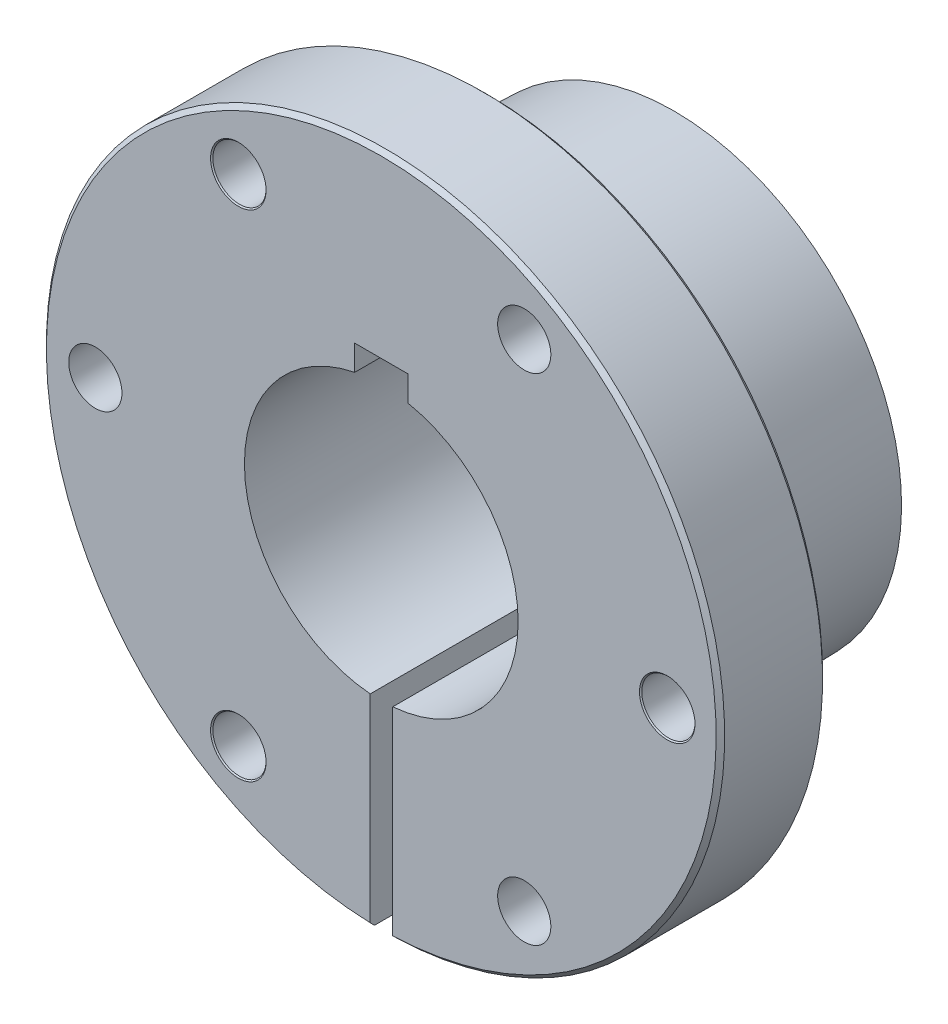
ISO-10303-21;
HEADER;
FILE_DESCRIPTION(('STEP AP214'),'2;1');
FILE_NAME('part.step','',(''),(''),'','','');
FILE_SCHEMA(('AUTOMOTIVE_DESIGN { 1 0 10303 214 1 1 1 1 }'));
ENDSEC;
DATA;
#1=APPLICATION_CONTEXT('core data for automotive mechanical design processes');
#2=APPLICATION_PROTOCOL_DEFINITION('international standard','automotive_design',2000,#1);
#3=PRODUCT_CONTEXT('',#1,'mechanical');
#4=PRODUCT('Part','Part','',(#3));
#5=PRODUCT_RELATED_PRODUCT_CATEGORY('part','',(#4));
#6=PRODUCT_DEFINITION_FORMATION('','',#4);
#7=PRODUCT_DEFINITION_CONTEXT('part definition',#1,'design');
#8=PRODUCT_DEFINITION('design','',#6,#7);
#9=PRODUCT_DEFINITION_SHAPE('','',#8);
#10=(LENGTH_UNIT() NAMED_UNIT(*) SI_UNIT(.MILLI.,.METRE.));
#11=(NAMED_UNIT(*) PLANE_ANGLE_UNIT() SI_UNIT($,.RADIAN.));
#12=(NAMED_UNIT(*) SI_UNIT($,.STERADIAN.) SOLID_ANGLE_UNIT());
#13=UNCERTAINTY_MEASURE_WITH_UNIT(LENGTH_MEASURE(1.E-05),#10,'distance_accuracy_value','');
#14=(GEOMETRIC_REPRESENTATION_CONTEXT(3) GLOBAL_UNCERTAINTY_ASSIGNED_CONTEXT((#13)) GLOBAL_UNIT_ASSIGNED_CONTEXT((#10,
#11,#12)) REPRESENTATION_CONTEXT('',''));
#15=CARTESIAN_POINT('',(0.,0.,0.));
#16=DIRECTION('',(0.,0.,1.));
#17=DIRECTION('',(1.,0.,0.));
#18=AXIS2_PLACEMENT_3D('',#15,#16,#17);
#19=CARTESIAN_POINT('',(-1.88408363451055E-13,26.98115,-12.7));
#20=DIRECTION('',(0.,0.,-1.));
#21=DIRECTION('',(-1.,0.,0.));
#22=AXIS2_PLACEMENT_3D('',#19,#20,#21);
#23=PLANE('',#22);
#24=DIRECTION('',(0.,1.,0.));
#25=VECTOR('',#24,1.);
#26=CARTESIAN_POINT('',(-1.3174067541024,26.98115,-12.7));
#27=LINE('',#26,#25);
#28=CARTESIAN_POINT('',(-1.3174067541024,-39.9515350769748,-12.7));
#29=VERTEX_POINT('',#28);
#30=CARTESIAN_POINT('',(-1.3174067541024,-26.9489683432733,-12.7));
#31=VERTEX_POINT('',#30);
#32=EDGE_CURVE('E374',#29,#31,#27,.T.);
#33=ORIENTED_EDGE('',*,*,#32,.F.);
#34=CARTESIAN_POINT('',(0.,0.,-12.7));
#35=DIRECTION('',(0.,0.,1.));
#36=DIRECTION('',(1.,0.,0.));
#37=AXIS2_PLACEMENT_3D('',#34,#35,#36);
#38=CIRCLE('',#37,39.97325);
#39=CARTESIAN_POINT('',(1.36807624464481,-39.949832076635,-12.7));
#40=VERTEX_POINT('',#39);
#41=EDGE_CURVE('E267',#40,#29,#38,.T.);
#42=ORIENTED_EDGE('',*,*,#41,.F.);
#43=DIRECTION('',(0.,-1.,0.));
#44=VECTOR('',#43,1.);
#45=CARTESIAN_POINT('',(1.36807624464481,26.98115,-12.7));
#46=LINE('',#45,#44);
#47=CARTESIAN_POINT('',(1.36807624464481,-26.9464436004334,-12.7));
#48=VERTEX_POINT('',#47);
#49=EDGE_CURVE('E394',#48,#40,#46,.T.);
#50=ORIENTED_EDGE('',*,*,#49,.F.);
#51=CARTESIAN_POINT('',(0.,0.,-12.7));
#52=DIRECTION('',(0.,0.,1.));
#53=DIRECTION('',(1.,0.,0.));
#54=AXIS2_PLACEMENT_3D('',#51,#52,#53);
#55=CIRCLE('',#54,26.98115);
#56=EDGE_CURVE('E271',#48,#31,#55,.T.);
#57=ORIENTED_EDGE('',*,*,#56,.T.);
#58=EDGE_LOOP('',(#33,#42,#50,#57));
#59=FACE_BOUND('',#58,.T.);
#60=CARTESIAN_POINT('',(-17.0656250000001,29.5585295629176,-12.7));
#61=DIRECTION('',(0.,0.,-1.));
#62=DIRECTION('',(-1.,0.,0.));
#63=AXIS2_PLACEMENT_3D('',#60,#61,#62);
#64=CIRCLE('',#63,3.31248153285078);
#65=CARTESIAN_POINT('',(-20.3781065328509,29.5585295629176,-12.7));
#66=VERTEX_POINT('',#65);
#67=EDGE_CURVE('E209',#66,#66,#64,.F.);
#68=ORIENTED_EDGE('',*,*,#67,.T.);
#69=EDGE_LOOP('',(#68));
#70=FACE_BOUND('',#69,.T.);
#71=CARTESIAN_POINT('',(17.0656249999997,29.5585295629178,-12.7));
#72=DIRECTION('',(0.,0.,-1.));
#73=DIRECTION('',(-1.,0.,0.));
#74=AXIS2_PLACEMENT_3D('',#71,#72,#73);
#75=CIRCLE('',#74,3.175);
#76=CARTESIAN_POINT('',(13.8906249999997,29.5585295629178,-12.7));
#77=VERTEX_POINT('',#76);
#78=EDGE_CURVE('E223',#77,#77,#75,.F.);
#79=ORIENTED_EDGE('',*,*,#78,.T.);
#80=EDGE_LOOP('',(#79));
#81=FACE_BOUND('',#80,.T.);
#82=CARTESIAN_POINT('',(17.0656250000001,-29.5585295629175,-12.7));
#83=DIRECTION('',(0.,0.,-1.));
#84=DIRECTION('',(-1.,0.,0.));
#85=AXIS2_PLACEMENT_3D('',#82,#83,#84);
#86=CIRCLE('',#85,3.175);
#87=CARTESIAN_POINT('',(13.8906250000001,-29.5585295629175,-12.7));
#88=VERTEX_POINT('',#87);
#89=EDGE_CURVE('E228',#88,#88,#86,.F.);
#90=ORIENTED_EDGE('',*,*,#89,.T.);
#91=EDGE_LOOP('',(#90));
#92=FACE_BOUND('',#91,.T.);
#93=CARTESIAN_POINT('',(-34.13125,0.,-12.7));
#94=DIRECTION('',(0.,0.,-1.));
#95=DIRECTION('',(-1.,0.,0.));
#96=AXIS2_PLACEMENT_3D('',#93,#94,#95);
#97=CIRCLE('',#96,3.175);
#98=CARTESIAN_POINT('',(-37.30625,0.,-12.7));
#99=VERTEX_POINT('',#98);
#100=EDGE_CURVE('E249',#99,#99,#97,.F.);
#101=ORIENTED_EDGE('',*,*,#100,.T.);
#102=EDGE_LOOP('',(#101));
#103=FACE_BOUND('',#102,.T.);
#104=CARTESIAN_POINT('',(34.13125,0.,-12.7));
#105=DIRECTION('',(0.,0.,-1.));
#106=DIRECTION('',(-1.,0.,0.));
#107=AXIS2_PLACEMENT_3D('',#104,#105,#106);
#108=CIRCLE('',#107,3.31248153285078);
#109=CARTESIAN_POINT('',(30.8187684671492,0.,-12.7));
#110=VERTEX_POINT('',#109);
#111=EDGE_CURVE('E240',#110,#110,#108,.F.);
#112=ORIENTED_EDGE('',*,*,#111,.T.);
#113=EDGE_LOOP('',(#112));
#114=FACE_BOUND('',#113,.T.);
#115=CARTESIAN_POINT('',(-17.0656249999997,-29.5585295629178,-12.7));
#116=DIRECTION('',(0.,0.,-1.));
#117=DIRECTION('',(-1.,0.,0.));
#118=AXIS2_PLACEMENT_3D('',#115,#116,#117);
#119=CIRCLE('',#118,3.31248153285078);
#120=CARTESIAN_POINT('',(-20.3781065328505,-29.5585295629178,-12.7));
#121=VERTEX_POINT('',#120);
#122=EDGE_CURVE('E204',#121,#121,#119,.F.);
#123=ORIENTED_EDGE('',*,*,#122,.T.);
#124=EDGE_LOOP('',(#123));
#125=FACE_BOUND('',#124,.T.);
#126=ADVANCED_FACE('F40',(#59,#70,#81,#92,#103,#114,#125),#23,.T.);
#127=CARTESIAN_POINT('',(-17.0656249999997,-29.5585295629178,-34.926));
#128=DIRECTION('',(0.,0.,1.));
#129=DIRECTION('',(1.,0.,0.));
#130=AXIS2_PLACEMENT_3D('',#127,#128,#129);
#131=CYLINDRICAL_SURFACE('',#130,3.175);
#132=CARTESIAN_POINT('',(-17.0656249999997,-29.5585295629178,-0.137481532850775));
#133=DIRECTION('',(0.,0.,1.));
#134=DIRECTION('',(1.,0.,0.));
#135=AXIS2_PLACEMENT_3D('',#132,#133,#134);
#136=CIRCLE('',#135,3.175);
#137=CARTESIAN_POINT('',(-13.8906249999997,-29.5585295629178,-0.137481532850775));
#138=VERTEX_POINT('',#137);
#139=EDGE_CURVE('E213',#138,#138,#136,.T.);
#140=ORIENTED_EDGE('',*,*,#139,.T.);
#141=EDGE_LOOP('',(#140));
#142=FACE_BOUND('',#141,.T.);
#143=CARTESIAN_POINT('',(-17.0656249999997,-29.5585295629178,-12.5625184671492));
#144=DIRECTION('',(0.,0.,-1.));
#145=DIRECTION('',(-1.,0.,0.));
#146=AXIS2_PLACEMENT_3D('',#143,#144,#145);
#147=CIRCLE('',#146,3.175);
#148=CARTESIAN_POINT('',(-20.2406249999997,-29.5585295629178,-12.5625184671492));
#149=VERTEX_POINT('',#148);
#150=EDGE_CURVE('E200',#149,#149,#147,.F.);
#151=ORIENTED_EDGE('',*,*,#150,.F.);
#152=EDGE_LOOP('',(#151));
#153=FACE_BOUND('',#152,.T.);
#154=ADVANCED_FACE('F454',(#142,#153),#131,.F.);
#155=CARTESIAN_POINT('',(-17.0656250000001,29.5585295629176,-34.926));
#156=DIRECTION('',(0.,0.,1.));
#157=DIRECTION('',(1.,0.,0.));
#158=AXIS2_PLACEMENT_3D('',#155,#156,#157);
#159=CYLINDRICAL_SURFACE('',#158,3.175);
#160=CARTESIAN_POINT('',(-17.0656250000001,29.5585295629176,-0.137481532850775));
#161=DIRECTION('',(0.,0.,1.));
#162=DIRECTION('',(1.,0.,0.));
#163=AXIS2_PLACEMENT_3D('',#160,#161,#162);
#164=CIRCLE('',#163,3.175);
#165=CARTESIAN_POINT('',(-13.8906250000001,29.5585295629176,-0.137481532850775));
#166=VERTEX_POINT('',#165);
#167=EDGE_CURVE('E218',#166,#166,#164,.T.);
#168=ORIENTED_EDGE('',*,*,#167,.T.);
#169=EDGE_LOOP('',(#168));
#170=FACE_BOUND('',#169,.T.);
#171=CARTESIAN_POINT('',(-17.0656250000001,29.5585295629176,-12.5625184671492));
#172=DIRECTION('',(0.,0.,-1.));
#173=DIRECTION('',(-1.,0.,0.));
#174=AXIS2_PLACEMENT_3D('',#171,#172,#173);
#175=CIRCLE('',#174,3.175);
#176=CARTESIAN_POINT('',(-20.2406250000001,29.5585295629176,-12.5625184671492));
#177=VERTEX_POINT('',#176);
#178=EDGE_CURVE('E208',#177,#177,#175,.F.);
#179=ORIENTED_EDGE('',*,*,#178,.F.);
#180=EDGE_LOOP('',(#179));
#181=FACE_BOUND('',#180,.T.);
#182=ADVANCED_FACE('F476',(#170,#181),#159,.F.);
#183=CARTESIAN_POINT('',(34.13125,0.,-34.926));
#184=DIRECTION('',(0.,0.,1.));
#185=DIRECTION('',(1.,0.,0.));
#186=AXIS2_PLACEMENT_3D('',#183,#184,#185);
#187=CYLINDRICAL_SURFACE('',#186,3.175);
#188=CARTESIAN_POINT('',(34.13125,0.,-0.137481532850775));
#189=DIRECTION('',(0.,0.,1.));
#190=DIRECTION('',(1.,0.,0.));
#191=AXIS2_PLACEMENT_3D('',#188,#189,#190);
#192=CIRCLE('',#191,3.175);
#193=CARTESIAN_POINT('',(37.30625,0.,-0.137481532850775));
#194=VERTEX_POINT('',#193);
#195=EDGE_CURVE('E244',#194,#194,#192,.T.);
#196=ORIENTED_EDGE('',*,*,#195,.T.);
#197=EDGE_LOOP('',(#196));
#198=FACE_BOUND('',#197,.T.);
#199=CARTESIAN_POINT('',(34.13125,0.,-12.5625184671492));
#200=DIRECTION('',(0.,0.,-1.));
#201=DIRECTION('',(-1.,0.,0.));
#202=AXIS2_PLACEMENT_3D('',#199,#200,#201);
#203=CIRCLE('',#202,3.175);
#204=CARTESIAN_POINT('',(30.95625,0.,-12.5625184671492));
#205=VERTEX_POINT('',#204);
#206=EDGE_CURVE('E236',#205,#205,#203,.F.);
#207=ORIENTED_EDGE('',*,*,#206,.F.);
#208=EDGE_LOOP('',(#207));
#209=FACE_BOUND('',#208,.T.);
#210=ADVANCED_FACE('F483',(#198,#209),#187,.F.);
#211=CARTESIAN_POINT('',(-1.10854532508269E-13,15.875,-34.925));
#212=DIRECTION('',(0.,0.,-1.));
#213=DIRECTION('',(-1.,0.,0.));
#214=AXIS2_PLACEMENT_3D('',#211,#212,#213);
#215=PLANE('',#214);
#216=DIRECTION('',(0.,-1.,0.));
#217=VECTOR('',#216,1.);
#218=CARTESIAN_POINT('',(-1.3174067541024,-15.1992533744806,-34.925));
#219=LINE('',#218,#217);
#220=CARTESIAN_POINT('',(-1.3174067541024,-16.2819391023354,-34.925));
#221=VERTEX_POINT('',#220);
#222=CARTESIAN_POINT('',(-1.3174067541024,-27.1476410782668,-34.925));
#223=VERTEX_POINT('',#222);
#224=EDGE_CURVE('E63',#221,#223,#219,.T.);
#225=ORIENTED_EDGE('',*,*,#224,.T.);
#226=CARTESIAN_POINT('',(0.,0.,-34.925));
#227=DIRECTION('',(0.,0.,1.));
#228=DIRECTION('',(1.,0.,0.));
#229=AXIS2_PLACEMENT_3D('',#226,#227,#228);
#230=CIRCLE('',#229,27.1795875);
#231=CARTESIAN_POINT('',(1.36807624464481,-27.145134813793,-34.925));
#232=VERTEX_POINT('',#231);
#233=EDGE_CURVE('E283',#232,#223,#230,.T.);
#234=ORIENTED_EDGE('',*,*,#233,.F.);
#235=DIRECTION('',(0.,1.,0.));
#236=VECTOR('',#235,1.);
#237=CARTESIAN_POINT('',(1.36807624464481,-15.1992533744806,-34.925));
#238=LINE('',#237,#236);
#239=CARTESIAN_POINT('',(1.36807624464481,-16.2777599465268,-34.925));
#240=VERTEX_POINT('',#239);
#241=EDGE_CURVE('E324',#232,#240,#238,.T.);
#242=ORIENTED_EDGE('',*,*,#241,.T.);
#243=CARTESIAN_POINT('',(0.,0.,-34.925));
#244=DIRECTION('',(0.,0.,1.));
#245=DIRECTION('',(1.,0.,0.));
#246=AXIS2_PLACEMENT_3D('',#243,#244,#245);
#247=CIRCLE('',#246,16.3351492643292);
#248=CARTESIAN_POINT('',(3.175,16.0236224521147,-34.925));
#249=VERTEX_POINT('',#248);
#250=EDGE_CURVE('E163',#240,#249,#247,.T.);
#251=ORIENTED_EDGE('',*,*,#250,.T.);
#252=DIRECTION('',(0.,1.,0.));
#253=VECTOR('',#252,1.);
#254=CARTESIAN_POINT('',(3.175,19.05,-34.925));
#255=LINE('',#254,#253);
#256=CARTESIAN_POINT('',(3.175,19.05,-34.925));
#257=VERTEX_POINT('',#256);
#258=EDGE_CURVE('E180',#249,#257,#255,.T.);
#259=ORIENTED_EDGE('',*,*,#258,.T.);
#260=DIRECTION('',(-1.,0.,0.));
#261=VECTOR('',#260,1.);
#262=CARTESIAN_POINT('',(-3.175,19.05,-34.925));
#263=LINE('',#262,#261);
#264=CARTESIAN_POINT('',(-3.175,19.05,-34.925));
#265=VERTEX_POINT('',#264);
#266=EDGE_CURVE('E184',#257,#265,#263,.T.);
#267=ORIENTED_EDGE('',*,*,#266,.T.);
#268=DIRECTION('',(0.,-1.,0.));
#269=VECTOR('',#268,1.);
#270=CARTESIAN_POINT('',(-3.175,19.05,-34.925));
#271=LINE('',#270,#269);
#272=CARTESIAN_POINT('',(-3.175,16.0236224521147,-34.925));
#273=VERTEX_POINT('',#272);
#274=EDGE_CURVE('E176',#265,#273,#271,.T.);
#275=ORIENTED_EDGE('',*,*,#274,.T.);
#276=EDGE_CURVE('E168',#273,#221,#247,.T.);
#277=ORIENTED_EDGE('',*,*,#276,.T.);
#278=EDGE_LOOP('',(#225,#234,#242,#251,#259,#267,#275,#277));
#279=FACE_BOUND('',#278,.T.);
#280=ADVANCED_FACE('F42',(#279),#215,.T.);
#281=CARTESIAN_POINT('',(0.,0.,-15.875));
#282=DIRECTION('',(0.,0.,1.));
#283=DIRECTION('',(1.,0.,0.));
#284=AXIS2_PLACEMENT_3D('',#281,#282,#283);
#285=CONICAL_SURFACE('',#284,27.7749,0.0312398334302683);
#286=CARTESIAN_POINT('',(-1.3174067541024,-28.6001663855815,11.503947172358));
#287=CARTESIAN_POINT('',(-1.3174067541024,-28.140006425056,-3.20565896308949));
#288=CARTESIAN_POINT('',(-1.3174067541024,-27.6798191444389,-17.9152642437822));
#289=CARTESIAN_POINT('',(-1.3174067541024,-26.7593899430213,-47.3344730956632));
#290=CARTESIAN_POINT('',(-1.3174067541024,-26.2991480222207,-62.0440766668514));
#291=CARTESIAN_POINT('',(-1.3174067541024,-25.8388787813286,-76.7536793832849));
#292=B_SPLINE_CURVE_WITH_KNOTS('',3,(#286,#287,#288,#289,#290,#291),.UNSPECIFIED.,.F.,.F.,(4,2,
4),(0.,44.1504058715571,88.3008117431296),.UNSPECIFIED.);
#293=CARTESIAN_POINT('',(-1.3174067541024,-27.7436390809541,-15.875));
#294=VERTEX_POINT('',#293);
#295=EDGE_CURVE('E412',#294,#223,#292,.T.);
#296=ORIENTED_EDGE('',*,*,#295,.F.);
#297=CARTESIAN_POINT('',(0.,0.,-15.875));
#298=DIRECTION('',(0.,0.,1.));
#299=DIRECTION('',(1.,0.,0.));
#300=AXIS2_PLACEMENT_3D('',#297,#298,#299);
#301=CIRCLE('',#300,27.7749);
#302=CARTESIAN_POINT('',(1.36807624464481,-27.741186661692,-15.875));
#303=VERTEX_POINT('',#302);
#304=EDGE_CURVE('E279',#303,#294,#301,.T.);
#305=ORIENTED_EDGE('',*,*,#304,.F.);
#306=CARTESIAN_POINT('',(1.36807624464481,-25.8362478532771,-76.7536060912908));
#307=CARTESIAN_POINT('',(1.36807624464481,-26.2965637285559,-62.0440048341225));
#308=CARTESIAN_POINT('',(1.36807624464481,-26.7568501336511,-47.3344026548453));
#309=CARTESIAN_POINT('',(1.36807624464481,-27.6773640034746,-17.9151964520791));
#310=CARTESIAN_POINT('',(1.36807624464481,-28.1375914682028,-3.2055924285901));
#311=CARTESIAN_POINT('',(1.36807624464481,-28.5977894627476,11.5040125170079));
#312=B_SPLINE_CURVE_WITH_KNOTS('',3,(#306,#307,#308,#309,#310,#311),.UNSPECIFIED.,.F.,.F.,(4,2,
4),(0.,44.1504058715863,88.3008117431546),.UNSPECIFIED.);
#313=EDGE_CURVE('E170',#232,#303,#312,.T.);
#314=ORIENTED_EDGE('',*,*,#313,.F.);
#315=ORIENTED_EDGE('',*,*,#233,.T.);
#316=EDGE_LOOP('',(#296,#305,#314,#315));
#317=FACE_BOUND('',#316,.T.);
#318=ADVANCED_FACE('F335',(#317),#285,.T.);
#319=CARTESIAN_POINT('',(-1.93951090076468E-13,27.7749,-15.875));
#320=DIRECTION('',(0.,0.,1.));
#321=DIRECTION('',(1.,0.,0.));
#322=AXIS2_PLACEMENT_3D('',#319,#320,#321);
#323=PLANE('',#322);
#324=DIRECTION('',(0.,-1.,0.));
#325=VECTOR('',#324,1.);
#326=CARTESIAN_POINT('',(-1.3174067541024,27.7749,-15.875));
#327=LINE('',#326,#325);
#328=CARTESIAN_POINT('',(-1.3174067541024,-26.9489683432733,-15.875));
#329=VERTEX_POINT('',#328);
#330=EDGE_CURVE('E420',#329,#294,#327,.T.);
#331=ORIENTED_EDGE('',*,*,#330,.F.);
#332=CARTESIAN_POINT('',(0.,0.,-15.875));
#333=DIRECTION('',(0.,0.,1.));
#334=DIRECTION('',(1.,0.,0.));
#335=AXIS2_PLACEMENT_3D('',#332,#333,#334);
#336=CIRCLE('',#335,26.98115);
#337=CARTESIAN_POINT('',(1.36807624464481,-26.9464436004334,-15.875));
#338=VERTEX_POINT('',#337);
#339=EDGE_CURVE('E275',#338,#329,#336,.T.);
#340=ORIENTED_EDGE('',*,*,#339,.F.);
#341=DIRECTION('',(0.,1.,0.));
#342=VECTOR('',#341,1.);
#343=CARTESIAN_POINT('',(1.36807624464481,27.7749,-15.875));
#344=LINE('',#343,#342);
#345=EDGE_CURVE('E337',#303,#338,#344,.T.);
#346=ORIENTED_EDGE('',*,*,#345,.F.);
#347=ORIENTED_EDGE('',*,*,#304,.T.);
#348=EDGE_LOOP('',(#331,#340,#346,#347));
#349=FACE_BOUND('',#348,.T.);
#350=ADVANCED_FACE('F410',(#349),#323,.T.);
#351=CARTESIAN_POINT('',(0.,0.,0.));
#352=DIRECTION('',(0.,0.,1.));
#353=DIRECTION('',(1.,0.,0.));
#354=AXIS2_PLACEMENT_3D('',#351,#352,#353);
#355=CYLINDRICAL_SURFACE('',#354,26.98115);
#356=DIRECTION('',(0.,0.,1.));
#357=VECTOR('',#356,1.);
#358=CARTESIAN_POINT('',(-1.3174067541024,-26.9489683432733,0.));
#359=LINE('',#358,#357);
#360=EDGE_CURVE('E439',#31,#329,#359,.F.);
#361=ORIENTED_EDGE('',*,*,#360,.F.);
#362=ORIENTED_EDGE('',*,*,#56,.F.);
#363=DIRECTION('',(0.,0.,1.));
#364=VECTOR('',#363,1.);
#365=CARTESIAN_POINT('',(1.36807624464481,-26.9464436004334,0.));
#366=LINE('',#365,#364);
#367=EDGE_CURVE('E399',#338,#48,#366,.T.);
#368=ORIENTED_EDGE('',*,*,#367,.F.);
#369=ORIENTED_EDGE('',*,*,#339,.T.);
#370=EDGE_LOOP('',(#361,#362,#368,#369));
#371=FACE_BOUND('',#370,.T.);
#372=ADVANCED_FACE('F381',(#371),#355,.T.);
#373=CARTESIAN_POINT('',(0.,0.,-12.192));
#374=DIRECTION('',(0.,0.,1.));
#375=DIRECTION('',(1.,0.,0.));
#376=AXIS2_PLACEMENT_3D('',#373,#374,#375);
#377=CONICAL_SURFACE('',#376,40.48125,0.785398163397457);
#378=CARTESIAN_POINT('',(-1.3174067541024,-70.9786369408079,18.3176118241158));
#379=CARTESIAN_POINT('',(-1.3174067541024,-68.2940295840964,15.6334722445099));
#380=CARTESIAN_POINT('',(-1.3174067541024,-65.6094010982601,12.9493537954714));
#381=CARTESIAN_POINT('',(-1.3174067541024,-60.2400682033212,7.58119401592405));
#382=CARTESIAN_POINT('',(-1.3174067541024,-57.5553637942356,4.89715268539844));
#383=CARTESIAN_POINT('',(-1.3174067541024,-52.1858458336464,-0.470817554186729));
#384=CARTESIAN_POINT('',(-1.3174067541024,-49.5010322822099,-3.15474646331331));
#385=CARTESIAN_POINT('',(-1.3174067541024,-44.1312282783333,-8.52242846225312));
#386=CARTESIAN_POINT('',(-1.3174067541024,-41.4462378258556,-11.2061815520287));
#387=CARTESIAN_POINT('',(-1.3174067541024,-37.4185154394126,-15.2315776802028));
#388=CARTESIAN_POINT('',(-1.3174067541024,-36.0759010254439,-16.5733383050363));
#389=CARTESIAN_POINT('',(-1.3174067541024,-33.3905616371507,-19.2567486900001));
#390=CARTESIAN_POINT('',(-1.3174067541024,-32.0478366628355,-20.5983984501396));
#391=CARTESIAN_POINT('',(-1.3174067541024,-29.3622289295959,-23.2815382956878));
#392=CARTESIAN_POINT('',(-1.3174067541024,-28.0193461707749,-24.6230283812));
#393=CARTESIAN_POINT('',(-1.3174067541024,-25.3333383679744,-27.3057667849701));
#394=CARTESIAN_POINT('',(-1.3174067541024,-23.990213323922,-28.647015103155));
#395=CARTESIAN_POINT('',(-1.3174067541024,-21.3035733204295,-31.3291272742027));
#396=CARTESIAN_POINT('',(-1.3174067541024,-19.96005836012,-32.6699911261946));
#397=CARTESIAN_POINT('',(-1.3174067541024,-17.9442589298203,-34.6807572379376));
#398=CARTESIAN_POINT('',(-1.3174067541024,-17.2722383001847,-35.3509239865985));
#399=CARTESIAN_POINT('',(-1.3174067541024,-15.9279452246692,-36.6910053314817));
#400=CARTESIAN_POINT('',(-1.3174067541024,-15.2556727787099,-37.3609199276243));
#401=CARTESIAN_POINT('',(-1.3174067541024,-13.9107568801773,-38.7003814001814));
#402=CARTESIAN_POINT('',(-1.3174067541024,-13.2381134262962,-39.3699282752829));
#403=CARTESIAN_POINT('',(-1.3174067541024,-11.8922599057022,-40.7084513746082));
#404=CARTESIAN_POINT('',(-1.3174067541024,-11.2190498394875,-41.3774275993327));
#405=CARTESIAN_POINT('',(-1.3174067541024,-10.2085121453067,-42.3801666315509));
#406=CARTESIAN_POINT('',(-1.3174067541024,-9.87154511351239,-42.7142927853256));
#407=CARTESIAN_POINT('',(-1.3174067541024,-9.19728047027653,-43.3822110752478));
#408=CARTESIAN_POINT('',(-1.3174067541024,-8.85998285899246,-43.7160032115543));
#409=CARTESIAN_POINT('',(-1.3174067541024,-8.18493686873142,-44.3831337807752));
#410=CARTESIAN_POINT('',(-1.3174067541024,-7.84718848834865,-44.716472212268));
#411=CARTESIAN_POINT('',(-1.3174067541024,-7.17100770830759,-45.3824555474074));
#412=CARTESIAN_POINT('',(-1.3174067541024,-6.83257530750914,-45.7151004498961));
#413=CARTESIAN_POINT('',(-1.3174067541024,-6.49368430742021,-46.0472786417615));
#414=B_SPLINE_CURVE_WITH_KNOTS('',3,(#378,#379,#380,#381,#382,#383,#384,#385,#386,#387,#388,
#389,#390,#391,#392,#393,#394,#395,#396,#397,#398,#399,#400,#401,#402,#403,#404,#405,#406,#407,
#408,#409,#410,#411,#412,#413),.UNSPECIFIED.,.F.,.F.,(4,2,2,2,2,2,2,2,2,2,2,2,2,2,2,2,2,4),(0.,
11.3888321410875,22.777661782798,34.1664845347967,45.5553097152387,51.2497293781842,
56.9441485612126,62.638564028824,68.3329812131647,74.0274111951488,76.874623260202,
79.7218362251988,82.569059291657,85.4162798575297,86.8398960594684,88.2635115834572,
89.6871315576637,91.1107539067657),.UNSPECIFIED.);
#415=CARTESIAN_POINT('',(-1.3174067541024,-40.4598077233042,-12.192));
#416=VERTEX_POINT('',#415);
#417=EDGE_CURVE('E366',#416,#29,#414,.T.);
#418=ORIENTED_EDGE('',*,*,#417,.F.);
#419=CARTESIAN_POINT('',(0.,0.,-12.192));
#420=DIRECTION('',(0.,0.,1.));
#421=DIRECTION('',(1.,0.,0.));
#422=AXIS2_PLACEMENT_3D('',#419,#420,#421);
#423=CIRCLE('',#422,40.48125);
#424=CARTESIAN_POINT('',(1.36807624464481,-40.4581261176459,-12.192));
#425=VERTEX_POINT('',#424);
#426=EDGE_CURVE('E263',#425,#416,#423,.T.);
#427=ORIENTED_EDGE('',*,*,#426,.F.);
#428=CARTESIAN_POINT('',(1.36807624464481,-6.48849476079435,-46.0420964900875));
#429=CARTESIAN_POINT('',(1.36807624464481,-6.71986066696949,-45.8156945387052));
#430=CARTESIAN_POINT('',(1.36807624464481,-6.95098305778035,-45.5890441591984));
#431=CARTESIAN_POINT('',(1.36807624464481,-7.41284110504122,-45.1353501434306));
#432=CARTESIAN_POINT('',(1.36807624464481,-7.64357676190551,-44.9083065075915));
#433=CARTESIAN_POINT('',(1.36807624464481,-8.33535345319254,-44.2267417309926));
#434=CARTESIAN_POINT('',(1.36807624464481,-8.79596557739029,-43.7717853790546));
#435=CARTESIAN_POINT('',(1.36807624464481,-9.71647971392866,-42.8611590766774));
#436=CARTESIAN_POINT('',(1.36807624464481,-10.1763817291439,-42.405489129142));
#437=CARTESIAN_POINT('',(1.36807624464481,-11.0957107875948,-41.4936695324715));
#438=CARTESIAN_POINT('',(1.36807624464481,-11.5551378303661,-41.0375198828683));
#439=CARTESIAN_POINT('',(1.36807624464481,-12.9329211943716,-39.6685922908865));
#440=CARTESIAN_POINT('',(1.36807624464481,-13.850790892827,-38.7553246668536));
#441=CARTESIAN_POINT('',(1.36807624464481,-15.6858330380567,-36.9280891201592));
#442=CARTESIAN_POINT('',(1.36807624464481,-16.6030054846775,-36.0141211973436));
#443=CARTESIAN_POINT('',(1.36807624464481,-19.3539023066414,-33.2715950762599));
#444=CARTESIAN_POINT('',(1.36807624464481,-21.1870061667928,-31.4424145226608));
#445=CARTESIAN_POINT('',(1.36807624464481,-24.8525112438741,-27.783334249091));
#446=CARTESIAN_POINT('',(1.36807624464481,-26.6849124577812,-25.9534345260935));
#447=CARTESIAN_POINT('',(1.36807624464481,-30.3493192926016,-22.2932395389615));
#448=CARTESIAN_POINT('',(1.36807624464481,-32.1813249135722,-20.4629442748844));
#449=CARTESIAN_POINT('',(1.36807624464481,-34.8044145980805,-17.8419718244159));
#450=CARTESIAN_POINT('',(1.36807624464481,-35.5955928866458,-17.051388925684));
#451=CARTESIAN_POINT('',(1.36807624464481,-37.1779117941212,-15.4701873602073));
#452=CARTESIAN_POINT('',(1.36807624464481,-37.9690524130759,-14.6795686935074));
#453=CARTESIAN_POINT('',(1.36807624464481,-41.4453773192764,-11.2054085728799));
#454=CARTESIAN_POINT('',(1.36807624464481,-44.1304075302939,-8.52171294839377));
#455=CARTESIAN_POINT('',(1.36807624464481,-49.5002776817116,-3.15413132787237));
#456=CARTESIAN_POINT('',(1.36807624464481,-52.1851176221107,-0.470245331836085));
#457=CARTESIAN_POINT('',(1.36807624464481,-57.5546920267884,4.89766004770411));
#458=CARTESIAN_POINT('',(1.36807624464481,-60.2394264904469,7.58167943182823));
#459=CARTESIAN_POINT('',(1.36807624464481,-65.6088128842965,12.9498007083344));
#460=CARTESIAN_POINT('',(1.36807624464481,-68.2934648144882,15.6339026007157));
#461=CARTESIAN_POINT('',(1.36807624464481,-70.97809394225,18.318027297186));
#462=B_SPLINE_CURVE_WITH_KNOTS('',3,(#428,#429,#430,#431,#432,#433,#434,#435,#436,#437,#438,
#439,#440,#441,#442,#443,#444,#445,#446,#447,#448,#449,#450,#451,#452,#453,#454,#455,#456,#457,
#458,#459,#460,#461),.UNSPECIFIED.,.F.,.F.,(4,2,2,2,2,2,2,2,2,2,2,2,2,2,2,2,4),(0.,
0.971128739339239,1.94225643769612,3.88450608286951,5.8267478448811,7.76899150436504,
11.6534317719703,15.5378728937905,23.3067551259747,31.0756704122033,38.8445845709357,
42.2000069951192,45.5554253275192,56.9442129924509,68.333000716165,79.7218475717223,
91.1106943317493),.UNSPECIFIED.);
#463=EDGE_CURVE('E386',#40,#425,#462,.T.);
#464=ORIENTED_EDGE('',*,*,#463,.F.);
#465=ORIENTED_EDGE('',*,*,#41,.T.);
#466=EDGE_LOOP('',(#418,#427,#464,#465));
#467=FACE_BOUND('',#466,.T.);
#468=ADVANCED_FACE('F376',(#467),#377,.T.);
#469=CARTESIAN_POINT('',(0.,0.,0.));
#470=DIRECTION('',(0.,0.,1.));
#471=DIRECTION('',(1.,0.,0.));
#472=AXIS2_PLACEMENT_3D('',#469,#470,#471);
#473=CYLINDRICAL_SURFACE('',#472,40.48125);
#474=DIRECTION('',(0.,0.,1.));
#475=VECTOR('',#474,1.);
#476=CARTESIAN_POINT('',(-1.3174067541024,-40.4598077233042,0.));
#477=LINE('',#476,#475);
#478=CARTESIAN_POINT('',(-1.3174067541024,-40.4598077233042,-0.508000000000009));
#479=VERTEX_POINT('',#478);
#480=EDGE_CURVE('E351',#479,#416,#477,.F.);
#481=ORIENTED_EDGE('',*,*,#480,.F.);
#482=CARTESIAN_POINT('',(0.,0.,-0.508000000000009));
#483=DIRECTION('',(0.,0.,1.));
#484=DIRECTION('',(1.,0.,0.));
#485=AXIS2_PLACEMENT_3D('',#482,#483,#484);
#486=CIRCLE('',#485,40.48125);
#487=CARTESIAN_POINT('',(1.36807624464481,-40.4581261176459,-0.508000000000009));
#488=VERTEX_POINT('',#487);
#489=EDGE_CURVE('E259',#488,#479,#486,.T.);
#490=ORIENTED_EDGE('',*,*,#489,.F.);
#491=DIRECTION('',(0.,0.,1.));
#492=VECTOR('',#491,1.);
#493=CARTESIAN_POINT('',(1.36807624464481,-40.4581261176459,0.));
#494=LINE('',#493,#492);
#495=EDGE_CURVE('E395',#425,#488,#494,.T.);
#496=ORIENTED_EDGE('',*,*,#495,.F.);
#497=ORIENTED_EDGE('',*,*,#426,.T.);
#498=EDGE_LOOP('',(#481,#490,#496,#497));
#499=FACE_BOUND('',#498,.T.);
#500=ADVANCED_FACE('F380',(#499),#473,.T.);
#501=CARTESIAN_POINT('',(0.,0.,0.));
#502=DIRECTION('',(0.,0.,-1.));
#503=DIRECTION('',(-1.,0.,0.));
#504=AXIS2_PLACEMENT_3D('',#501,#502,#503);
#505=CONICAL_SURFACE('',#504,39.97325,0.785398163397443);
#506=CARTESIAN_POINT('',(-1.3174067541024,-6.49368430742071,33.3472786417619));
#507=CARTESIAN_POINT('',(-1.3174067541024,-6.72469036277257,33.1208720979849));
#508=CARTESIAN_POINT('',(-1.3174067541024,-6.95547077250198,32.8942356899899));
#509=CARTESIAN_POINT('',(-1.3174067541024,-7.41667323538644,32.440598915318));
#510=CARTESIAN_POINT('',(-1.3174067541024,-7.64709528887118,32.2135985489763));
#511=CARTESIAN_POINT('',(-1.3174067541024,-8.33796278189991,31.5321956967332));
#512=CARTESIAN_POINT('',(-1.3174067541024,-8.79801072869494,31.077390304424));
#513=CARTESIAN_POINT('',(-1.3174067541024,-9.71744857774591,30.167118476693));
#514=CARTESIAN_POINT('',(-1.3174067541024,-10.176838482293,29.7116520435839));
#515=CARTESIAN_POINT('',(-1.3174067541024,-11.0951779775013,28.8002747978795));
#516=CARTESIAN_POINT('',(-1.3174067541024,-11.5541275677926,28.3443639849115));
#517=CARTESIAN_POINT('',(-1.3174067541024,-12.9305156435464,26.9761872591169));
#518=CARTESIAN_POINT('',(-1.3174067541024,-13.8475029945378,26.0634675808232));
#519=CARTESIAN_POINT('',(-1.3174067541024,-15.6808311817227,24.2373790877376));
#520=CARTESIAN_POINT('',(-1.3174067541024,-16.5971720177938,23.324010272823));
#521=CARTESIAN_POINT('',(-1.3174067541024,-19.3456191039628,20.5833268243713));
#522=CARTESIAN_POINT('',(-1.3174067541024,-21.1771499330536,18.7554351860938));
#523=CARTESIAN_POINT('',(-1.3174067541024,-24.8395593710267,15.0989854791212));
#524=CARTESIAN_POINT('',(-1.3174067541024,-26.6704379774962,13.2704274080103));
#525=CARTESIAN_POINT('',(-1.3174067541024,-30.3318282725852,9.61294439287919));
#526=CARTESIAN_POINT('',(-1.3174067541024,-32.1623399612507,7.7840194489048));
#527=CARTESIAN_POINT('',(-1.3174067541024,-34.7875053815599,5.16082142266599));
#528=CARTESIAN_POINT('',(-1.3174067541024,-35.5822463085889,4.3666355896295));
#529=CARTESIAN_POINT('',(-1.3174067541024,-37.1716929519231,2.77823036178022));
#530=CARTESIAN_POINT('',(-1.3174067541024,-37.9663986682645,1.98401096700364));
#531=CARTESIAN_POINT('',(-1.3174067541024,-41.4462322232337,-1.49381311643552));
#532=CARTESIAN_POINT('',(-1.3174067541024,-44.1312173056648,-4.17756064233079));
#533=CARTESIAN_POINT('',(-1.3174067541024,-49.501011030767,-9.54523222074544));
#534=CARTESIAN_POINT('',(-1.3174067541024,-52.1858196734373,-12.2291562732656));
#535=CARTESIAN_POINT('',(-1.3174067541024,-57.5553382108046,-17.5971271288978));
#536=CARTESIAN_POINT('',(-1.3174067541024,-60.2400481050072,-20.2811739325044));
#537=CARTESIAN_POINT('',(-1.3174067541024,-65.609391361262,-25.6493440501175));
#538=CARTESIAN_POINT('',(-1.3174067541024,-68.2940247233146,-28.3334673641234));
#539=CARTESIAN_POINT('',(-1.3174067541024,-70.9786369408075,-31.0176118241163));
#540=B_SPLINE_CURVE_WITH_KNOTS('',3,(#506,#507,#508,#509,#510,#511,#512,#513,#514,#515,#516,
#517,#518,#519,#520,#521,#522,#523,#524,#525,#526,#527,#528,#529,#530,#531,#532,#533,#534,#535,
#536,#537,#538,#539),.UNSPECIFIED.,.F.,.F.,(4,2,2,2,2,2,2,2,2,2,2,2,2,2,2,2,4),(0.,
0.970367173614763,1.94073345400553,3.88146107644258,5.82218192537005,7.76290440337639,
11.6443089707573,15.5257142726616,23.2885248720796,31.0513638962474,38.8142019490174,
42.1848248162996,45.5554441354293,56.9442461213024,68.333048157872,79.7219010454201,
91.110753850668),.UNSPECIFIED.);
#541=CARTESIAN_POINT('',(-1.3174067541024,-39.9515350769748,0.));
#542=VERTEX_POINT('',#541);
#543=EDGE_CURVE('E330',#542,#479,#540,.T.);
#544=ORIENTED_EDGE('',*,*,#543,.F.);
#545=CARTESIAN_POINT('',(0.,0.,0.));
#546=DIRECTION('',(0.,0.,1.));
#547=DIRECTION('',(1.,0.,0.));
#548=AXIS2_PLACEMENT_3D('',#545,#546,#547);
#549=CIRCLE('',#548,39.97325);
#550=CARTESIAN_POINT('',(1.36807624464481,-39.949832076635,0.));
#551=VERTEX_POINT('',#550);
#552=EDGE_CURVE('E156',#551,#542,#549,.T.);
#553=ORIENTED_EDGE('',*,*,#552,.F.);
#554=CARTESIAN_POINT('',(1.36807624464481,-70.9780939422496,-31.0180272971865));
#555=CARTESIAN_POINT('',(1.36807624464481,-68.2934704675461,-28.3339082749309));
#556=CARTESIAN_POINT('',(1.36807624464481,-65.608824207196,-25.6498120399993));
#557=CARTESIAN_POINT('',(1.36807624464481,-60.2394498611237,-20.2817027855433));
#558=CARTESIAN_POINT('',(1.36807624464481,-57.5547217754225,-17.5976897659977));
#559=CARTESIAN_POINT('',(1.36807624464481,-52.1851480431088,-12.2297851012076));
#560=CARTESIAN_POINT('',(1.36807624464481,-49.5003023965803,-9.54589345587904));
#561=CARTESIAN_POINT('',(1.36807624464481,-44.1304202871774,-4.1782997236141));
#562=CARTESIAN_POINT('',(1.36807624464481,-41.4453838242558,-1.49459763672488));
#563=CARTESIAN_POINT('',(1.36807624464481,-37.4175737279665,2.53070381479515));
#564=CARTESIAN_POINT('',(1.36807624464481,-36.0749268257224,3.87242998781455));
#565=CARTESIAN_POINT('',(1.36807624464481,-33.3895138054105,6.55576276408849));
#566=CARTESIAN_POINT('',(1.36807624464481,-32.0467476873545,7.89736936735473));
#567=CARTESIAN_POINT('',(1.36807624464481,-29.3610453756979,10.5804103002192));
#568=CARTESIAN_POINT('',(1.36807624464481,-28.0181091822271,11.9218446299475));
#569=CARTESIAN_POINT('',(1.36807624464481,-25.331975492187,14.6044525885998));
#570=CARTESIAN_POINT('',(1.36807624464481,-23.9887779955261,15.9456262174324));
#571=CARTESIAN_POINT('',(1.36807624464481,-21.301962285289,18.6275590962011));
#572=CARTESIAN_POINT('',(1.36807624464481,-19.9583440706224,19.9683183450452));
#573=CARTESIAN_POINT('',(1.36807624464481,-17.942348553765,21.978885910915));
#574=CARTESIAN_POINT('',(1.36807624464481,-17.2702557507844,22.6489794813926));
#575=CARTESIAN_POINT('',(1.36807624464481,-15.925798599368,23.9888946859072));
#576=CARTESIAN_POINT('',(1.36807624464481,-15.2534342508325,24.6587163198442));
#577=CARTESIAN_POINT('',(1.36807624464481,-13.9083053192054,25.9979631754936));
#578=CARTESIAN_POINT('',(1.36807624464481,-13.235540734474,26.667388395559));
#579=CARTESIAN_POINT('',(1.36807624464481,-11.8894006982987,28.0056232729204));
#580=CARTESIAN_POINT('',(1.36807624464481,-11.2160252474795,28.6744329308444));
#581=CARTESIAN_POINT('',(1.36807624464481,-10.2051829374439,29.6768651321922));
#582=CARTESIAN_POINT('',(1.36807624464481,-9.86810482929189,30.0108796249304));
#583=CARTESIAN_POINT('',(1.36807624464481,-9.19359226138955,30.6785482606122));
#584=CARTESIAN_POINT('',(1.36807624464481,-8.85615780183667,31.0122024037554));
#585=CARTESIAN_POINT('',(1.36807624464481,-8.18080289899406,31.6790212921786));
#586=CARTESIAN_POINT('',(1.36807624464481,-7.84288245394209,32.0121860356752));
#587=CARTESIAN_POINT('',(1.36807624464481,-7.16630432782542,32.6777672287717));
#588=CARTESIAN_POINT('',(1.36807624464481,-6.82764664533175,33.0101836769186));
#589=CARTESIAN_POINT('',(1.36807624464481,-6.48849476079485,33.342096490088));
#590=B_SPLINE_CURVE_WITH_KNOTS('',3,(#554,#555,#556,#557,#558,#559,#560,#561,#562,#563,#564,
#565,#566,#567,#568,#569,#570,#571,#572,#573,#574,#575,#576,#577,#578,#579,#580,#581,#582,#583,
#584,#585,#586,#587,#588,#589),.UNSPECIFIED.,.F.,.F.,(4,2,2,2,2,2,2,2,2,2,2,2,2,2,2,2,2,4),(0.,
11.388822731226,22.7776425557956,34.1664543679311,45.55526900423,51.2496845480608,
56.9440995337722,62.6385101986272,68.3329228599513,74.0273504040163,76.8745607733275,
79.7217721892209,82.5689953523063,85.4162156073505,86.8398326181695,88.2634488405809,
89.6870702382868,91.1106943978241),.UNSPECIFIED.);
#591=EDGE_CURVE('E419',#488,#551,#590,.T.);
#592=ORIENTED_EDGE('',*,*,#591,.F.);
#593=ORIENTED_EDGE('',*,*,#489,.T.);
#594=EDGE_LOOP('',(#544,#553,#592,#593));
#595=FACE_BOUND('',#594,.T.);
#596=ADVANCED_FACE('F353',(#595),#505,.T.);
#597=CARTESIAN_POINT('',(-1.1085453250827E-13,15.875,0.));
#598=DIRECTION('',(0.,0.,1.));
#599=DIRECTION('',(1.,0.,0.));
#600=AXIS2_PLACEMENT_3D('',#597,#598,#599);
#601=PLANE('',#600);
#602=DIRECTION('',(0.,-1.,0.));
#603=VECTOR('',#602,1.);
#604=CARTESIAN_POINT('',(-1.3174067541024,-15.1992533744806,0.));
#605=LINE('',#604,#603);
#606=CARTESIAN_POINT('',(-1.3174067541024,-16.2819391023354,0.));
#607=VERTEX_POINT('',#606);
#608=EDGE_CURVE('E140',#607,#542,#605,.T.);
#609=ORIENTED_EDGE('',*,*,#608,.F.);
#610=CARTESIAN_POINT('',(0.,0.,0.));
#611=DIRECTION('',(0.,0.,1.));
#612=DIRECTION('',(1.,0.,0.));
#613=AXIS2_PLACEMENT_3D('',#610,#611,#612);
#614=CIRCLE('',#613,16.3351492643292);
#615=CARTESIAN_POINT('',(-3.175,16.0236224521147,0.));
#616=VERTEX_POINT('',#615);
#617=EDGE_CURVE('E153',#616,#607,#614,.T.);
#618=ORIENTED_EDGE('',*,*,#617,.F.);
#619=DIRECTION('',(0.,-1.,0.));
#620=VECTOR('',#619,1.);
#621=CARTESIAN_POINT('',(-3.175,19.05,0.));
#622=LINE('',#621,#620);
#623=CARTESIAN_POINT('',(-3.175,19.05,0.));
#624=VERTEX_POINT('',#623);
#625=EDGE_CURVE('E175',#624,#616,#622,.T.);
#626=ORIENTED_EDGE('',*,*,#625,.F.);
#627=DIRECTION('',(-1.,0.,0.));
#628=VECTOR('',#627,1.);
#629=CARTESIAN_POINT('',(-3.175,19.05,0.));
#630=LINE('',#629,#628);
#631=CARTESIAN_POINT('',(3.175,19.05,0.));
#632=VERTEX_POINT('',#631);
#633=EDGE_CURVE('E181',#632,#624,#630,.T.);
#634=ORIENTED_EDGE('',*,*,#633,.F.);
#635=DIRECTION('',(0.,1.,0.));
#636=VECTOR('',#635,1.);
#637=CARTESIAN_POINT('',(3.175,19.05,0.));
#638=LINE('',#637,#636);
#639=CARTESIAN_POINT('',(3.175,16.0236224521147,0.));
#640=VERTEX_POINT('',#639);
#641=EDGE_CURVE('E191',#640,#632,#638,.T.);
#642=ORIENTED_EDGE('',*,*,#641,.F.);
#643=CARTESIAN_POINT('',(1.36807624464481,-16.2777599465268,0.));
#644=VERTEX_POINT('',#643);
#645=EDGE_CURVE('E164',#644,#640,#614,.T.);
#646=ORIENTED_EDGE('',*,*,#645,.F.);
#647=DIRECTION('',(0.,1.,0.));
#648=VECTOR('',#647,1.);
#649=CARTESIAN_POINT('',(1.36807624464481,-15.1992533744806,0.));
#650=LINE('',#649,#648);
#651=EDGE_CURVE('E56',#551,#644,#650,.T.);
#652=ORIENTED_EDGE('',*,*,#651,.F.);
#653=ORIENTED_EDGE('',*,*,#552,.T.);
#654=EDGE_LOOP('',(#609,#618,#626,#634,#642,#646,#652,#653));
#655=FACE_BOUND('',#654,.T.);
#656=CARTESIAN_POINT('',(-17.0656249999997,-29.5585295629178,0.));
#657=DIRECTION('',(0.,0.,1.));
#658=DIRECTION('',(1.,0.,0.));
#659=AXIS2_PLACEMENT_3D('',#656,#657,#658);
#660=CIRCLE('',#659,3.31248153285077);
#661=CARTESIAN_POINT('',(-13.753143467149,-29.5585295629178,0.));
#662=VERTEX_POINT('',#661);
#663=EDGE_CURVE('E214',#662,#662,#660,.T.);
#664=ORIENTED_EDGE('',*,*,#663,.F.);
#665=EDGE_LOOP('',(#664));
#666=FACE_BOUND('',#665,.T.);
#667=CARTESIAN_POINT('',(-17.0656250000001,29.5585295629176,0.));
#668=DIRECTION('',(0.,0.,1.));
#669=DIRECTION('',(1.,0.,0.));
#670=AXIS2_PLACEMENT_3D('',#667,#668,#669);
#671=CIRCLE('',#670,3.31248153285077);
#672=CARTESIAN_POINT('',(-13.7531434671494,29.5585295629176,0.));
#673=VERTEX_POINT('',#672);
#674=EDGE_CURVE('E219',#673,#673,#671,.T.);
#675=ORIENTED_EDGE('',*,*,#674,.F.);
#676=EDGE_LOOP('',(#675));
#677=FACE_BOUND('',#676,.T.);
#678=CARTESIAN_POINT('',(17.0656249999997,29.5585295629178,0.));
#679=DIRECTION('',(0.,0.,1.));
#680=DIRECTION('',(-0.499999999999992,-0.866025403784443,0.));
#681=AXIS2_PLACEMENT_3D('',#678,#679,#680);
#682=CIRCLE('',#681,3.175);
#683=CARTESIAN_POINT('',(15.4781249999997,26.8088989059022,0.));
#684=VERTEX_POINT('',#683);
#685=EDGE_CURVE('E224',#684,#684,#682,.T.);
#686=ORIENTED_EDGE('',*,*,#685,.F.);
#687=EDGE_LOOP('',(#686));
#688=FACE_BOUND('',#687,.T.);
#689=CARTESIAN_POINT('',(17.0656250000001,-29.5585295629175,0.));
#690=DIRECTION('',(0.,0.,1.));
#691=DIRECTION('',(-0.500000000000004,0.866025403784436,0.));
#692=AXIS2_PLACEMENT_3D('',#689,#690,#691);
#693=CIRCLE('',#692,3.175);
#694=CARTESIAN_POINT('',(15.4781250000001,-26.808898905902,0.));
#695=VERTEX_POINT('',#694);
#696=EDGE_CURVE('E232',#695,#695,#693,.T.);
#697=ORIENTED_EDGE('',*,*,#696,.F.);
#698=EDGE_LOOP('',(#697));
#699=FACE_BOUND('',#698,.T.);
#700=CARTESIAN_POINT('',(34.13125,0.,0.));
#701=DIRECTION('',(0.,0.,1.));
#702=DIRECTION('',(1.,0.,0.));
#703=AXIS2_PLACEMENT_3D('',#700,#701,#702);
#704=CIRCLE('',#703,3.31248153285077);
#705=CARTESIAN_POINT('',(37.4437315328508,0.,0.));
#706=VERTEX_POINT('',#705);
#707=EDGE_CURVE('E245',#706,#706,#704,.T.);
#708=ORIENTED_EDGE('',*,*,#707,.F.);
#709=EDGE_LOOP('',(#708));
#710=FACE_BOUND('',#709,.T.);
#711=CARTESIAN_POINT('',(-34.13125,0.,0.));
#712=DIRECTION('',(0.,0.,1.));
#713=DIRECTION('',(1.,0.,0.));
#714=AXIS2_PLACEMENT_3D('',#711,#712,#713);
#715=CIRCLE('',#714,3.175);
#716=CARTESIAN_POINT('',(-30.95625,0.,0.));
#717=VERTEX_POINT('',#716);
#718=EDGE_CURVE('E250',#717,#717,#715,.T.);
#719=ORIENTED_EDGE('',*,*,#718,.F.);
#720=EDGE_LOOP('',(#719));
#721=FACE_BOUND('',#720,.T.);
#722=ADVANCED_FACE('F150',(#655,#666,#677,#688,#699,#710,#721),#601,.T.);
#723=CARTESIAN_POINT('',(-34.13125,0.,-34.926));
#724=DIRECTION('',(0.,0.,1.));
#725=DIRECTION('',(1.,0.,0.));
#726=AXIS2_PLACEMENT_3D('',#723,#724,#725);
#727=CYLINDRICAL_SURFACE('',#726,3.175);
#728=ORIENTED_EDGE('',*,*,#100,.F.);
#729=EDGE_LOOP('',(#728));
#730=FACE_BOUND('',#729,.T.);
#731=ORIENTED_EDGE('',*,*,#718,.T.);
#732=EDGE_LOOP('',(#731));
#733=FACE_BOUND('',#732,.T.);
#734=ADVANCED_FACE('F501',(#730,#733),#727,.F.);
#735=CARTESIAN_POINT('',(34.13125,0.,0.));
#736=DIRECTION('',(0.,0.,1.));
#737=DIRECTION('',(1.,0.,0.));
#738=AXIS2_PLACEMENT_3D('',#735,#736,#737);
#739=CONICAL_SURFACE('',#738,3.31248153285077,0.78539816339745);
#740=ORIENTED_EDGE('',*,*,#707,.T.);
#741=EDGE_LOOP('',(#740));
#742=FACE_BOUND('',#741,.T.);
#743=ORIENTED_EDGE('',*,*,#195,.F.);
#744=EDGE_LOOP('',(#743));
#745=FACE_BOUND('',#744,.T.);
#746=ADVANCED_FACE('F497',(#742,#745),#739,.F.);
#747=CARTESIAN_POINT('',(34.13125,0.,-12.7));
#748=DIRECTION('',(0.,0.,-1.));
#749=DIRECTION('',(-1.,0.,0.));
#750=AXIS2_PLACEMENT_3D('',#747,#748,#749);
#751=CONICAL_SURFACE('',#750,3.31248153285078,0.78539816339745);
#752=ORIENTED_EDGE('',*,*,#111,.F.);
#753=EDGE_LOOP('',(#752));
#754=FACE_BOUND('',#753,.T.);
#755=ORIENTED_EDGE('',*,*,#206,.T.);
#756=EDGE_LOOP('',(#755));
#757=FACE_BOUND('',#756,.T.);
#758=ADVANCED_FACE('F492',(#754,#757),#751,.F.);
#759=CARTESIAN_POINT('',(17.0656250000001,-29.5585295629175,-34.926));
#760=DIRECTION('',(0.,0.,1.));
#761=DIRECTION('',(1.,0.,0.));
#762=AXIS2_PLACEMENT_3D('',#759,#760,#761);
#763=CYLINDRICAL_SURFACE('',#762,3.175);
#764=ORIENTED_EDGE('',*,*,#89,.F.);
#765=EDGE_LOOP('',(#764));
#766=FACE_BOUND('',#765,.T.);
#767=ORIENTED_EDGE('',*,*,#696,.T.);
#768=EDGE_LOOP('',(#767));
#769=FACE_BOUND('',#768,.T.);
#770=ADVANCED_FACE('F490',(#766,#769),#763,.F.);
#771=CARTESIAN_POINT('',(17.0656249999997,29.5585295629178,-34.926));
#772=DIRECTION('',(0.,0.,1.));
#773=DIRECTION('',(1.,0.,0.));
#774=AXIS2_PLACEMENT_3D('',#771,#772,#773);
#775=CYLINDRICAL_SURFACE('',#774,3.175);
#776=ORIENTED_EDGE('',*,*,#78,.F.);
#777=EDGE_LOOP('',(#776));
#778=FACE_BOUND('',#777,.T.);
#779=ORIENTED_EDGE('',*,*,#685,.T.);
#780=EDGE_LOOP('',(#779));
#781=FACE_BOUND('',#780,.T.);
#782=ADVANCED_FACE('F488',(#778,#781),#775,.F.);
#783=CARTESIAN_POINT('',(-17.0656250000001,29.5585295629176,0.));
#784=DIRECTION('',(0.,0.,1.));
#785=DIRECTION('',(-0.500000000000004,0.866025403784436,0.));
#786=AXIS2_PLACEMENT_3D('',#783,#784,#785);
#787=CONICAL_SURFACE('',#786,3.31248153285077,0.78539816339745);
#788=ORIENTED_EDGE('',*,*,#674,.T.);
#789=EDGE_LOOP('',(#788));
#790=FACE_BOUND('',#789,.T.);
#791=ORIENTED_EDGE('',*,*,#167,.F.);
#792=EDGE_LOOP('',(#791));
#793=FACE_BOUND('',#792,.T.);
#794=ADVANCED_FACE('F593',(#790,#793),#787,.F.);
#795=CARTESIAN_POINT('',(-17.0656249999997,-29.5585295629178,0.));
#796=DIRECTION('',(0.,0.,1.));
#797=DIRECTION('',(-0.499999999999992,-0.866025403784443,0.));
#798=AXIS2_PLACEMENT_3D('',#795,#796,#797);
#799=CONICAL_SURFACE('',#798,3.31248153285077,0.78539816339745);
#800=ORIENTED_EDGE('',*,*,#663,.T.);
#801=EDGE_LOOP('',(#800));
#802=FACE_BOUND('',#801,.T.);
#803=ORIENTED_EDGE('',*,*,#139,.F.);
#804=EDGE_LOOP('',(#803));
#805=FACE_BOUND('',#804,.T.);
#806=ADVANCED_FACE('F583',(#802,#805),#799,.F.);
#807=CARTESIAN_POINT('',(-17.0656250000001,29.5585295629176,-12.7));
#808=DIRECTION('',(0.,0.,-1.));
#809=DIRECTION('',(0.500000000000004,-0.866025403784436,0.));
#810=AXIS2_PLACEMENT_3D('',#807,#808,#809);
#811=CONICAL_SURFACE('',#810,3.31248153285078,0.78539816339745);
#812=ORIENTED_EDGE('',*,*,#67,.F.);
#813=EDGE_LOOP('',(#812));
#814=FACE_BOUND('',#813,.T.);
#815=ORIENTED_EDGE('',*,*,#178,.T.);
#816=EDGE_LOOP('',(#815));
#817=FACE_BOUND('',#816,.T.);
#818=ADVANCED_FACE('F471',(#814,#817),#811,.F.);
#819=CARTESIAN_POINT('',(-17.0656249999997,-29.5585295629178,-12.7));
#820=DIRECTION('',(0.,0.,-1.));
#821=DIRECTION('',(0.499999999999992,0.866025403784443,0.));
#822=AXIS2_PLACEMENT_3D('',#819,#820,#821);
#823=CONICAL_SURFACE('',#822,3.31248153285078,0.78539816339745);
#824=ORIENTED_EDGE('',*,*,#122,.F.);
#825=EDGE_LOOP('',(#824));
#826=FACE_BOUND('',#825,.T.);
#827=ORIENTED_EDGE('',*,*,#150,.T.);
#828=EDGE_LOOP('',(#827));
#829=FACE_BOUND('',#828,.T.);
#830=ADVANCED_FACE('F467',(#826,#829),#823,.F.);
#831=CARTESIAN_POINT('',(-3.175,19.05,-34.925));
#832=DIRECTION('',(-1.,0.,0.));
#833=DIRECTION('',(0.,0.,1.));
#834=AXIS2_PLACEMENT_3D('',#831,#832,#833);
#835=PLANE('',#834);
#836=ORIENTED_EDGE('',*,*,#625,.T.);
#837=DIRECTION('',(0.,0.,1.));
#838=VECTOR('',#837,1.);
#839=CARTESIAN_POINT('',(-3.175,16.0236224521147,-34.925));
#840=LINE('',#839,#838);
#841=EDGE_CURVE('E161',#616,#273,#840,.F.);
#842=ORIENTED_EDGE('',*,*,#841,.T.);
#843=ORIENTED_EDGE('',*,*,#274,.F.);
#844=DIRECTION('',(0.,0.,1.));
#845=VECTOR('',#844,1.);
#846=CARTESIAN_POINT('',(-3.175,19.05,-34.925));
#847=LINE('',#846,#845);
#848=EDGE_CURVE('E197',#265,#624,#847,.T.);
#849=ORIENTED_EDGE('',*,*,#848,.T.);
#850=EDGE_LOOP('',(#836,#842,#843,#849));
#851=FACE_BOUND('',#850,.T.);
#852=ADVANCED_FACE('F470',(#851),#835,.F.);
#853=CARTESIAN_POINT('',(-3.175,19.05,-34.925));
#854=DIRECTION('',(0.,1.,0.));
#855=DIRECTION('',(0.,0.,1.));
#856=AXIS2_PLACEMENT_3D('',#853,#854,#855);
#857=PLANE('',#856);
#858=ORIENTED_EDGE('',*,*,#633,.T.);
#859=ORIENTED_EDGE('',*,*,#848,.F.);
#860=ORIENTED_EDGE('',*,*,#266,.F.);
#861=DIRECTION('',(0.,0.,1.));
#862=VECTOR('',#861,1.);
#863=CARTESIAN_POINT('',(3.175,19.05,-34.925));
#864=LINE('',#863,#862);
#865=EDGE_CURVE('E188',#257,#632,#864,.T.);
#866=ORIENTED_EDGE('',*,*,#865,.T.);
#867=EDGE_LOOP('',(#858,#859,#860,#866));
#868=FACE_BOUND('',#867,.T.);
#869=ADVANCED_FACE('F318',(#868),#857,.F.);
#870=CARTESIAN_POINT('',(3.175,19.05,-34.925));
#871=DIRECTION('',(1.,0.,0.));
#872=DIRECTION('',(0.,0.,-1.));
#873=AXIS2_PLACEMENT_3D('',#870,#871,#872);
#874=PLANE('',#873);
#875=ORIENTED_EDGE('',*,*,#258,.F.);
#876=DIRECTION('',(0.,0.,1.));
#877=VECTOR('',#876,1.);
#878=CARTESIAN_POINT('',(3.175,16.0236224521147,-34.925));
#879=LINE('',#878,#877);
#880=EDGE_CURVE('E146',#249,#640,#879,.T.);
#881=ORIENTED_EDGE('',*,*,#880,.T.);
#882=ORIENTED_EDGE('',*,*,#641,.T.);
#883=ORIENTED_EDGE('',*,*,#865,.F.);
#884=EDGE_LOOP('',(#875,#881,#882,#883));
#885=FACE_BOUND('',#884,.T.);
#886=ADVANCED_FACE('F311',(#885),#874,.F.);
#887=CARTESIAN_POINT('',(0.,0.,-34.925));
#888=DIRECTION('',(0.,0.,1.));
#889=DIRECTION('',(1.,0.,0.));
#890=AXIS2_PLACEMENT_3D('',#887,#888,#889);
#891=CYLINDRICAL_SURFACE('',#890,16.3351492643292);
#892=ORIENTED_EDGE('',*,*,#250,.F.);
#893=DIRECTION('',(0.,0.,1.));
#894=VECTOR('',#893,1.);
#895=CARTESIAN_POINT('',(1.36807624464481,-16.2777599465268,-34.925));
#896=LINE('',#895,#894);
#897=EDGE_CURVE('E11',#240,#644,#896,.T.);
#898=ORIENTED_EDGE('',*,*,#897,.T.);
#899=ORIENTED_EDGE('',*,*,#645,.T.);
#900=ORIENTED_EDGE('',*,*,#880,.F.);
#901=EDGE_LOOP('',(#892,#898,#899,#900));
#902=FACE_BOUND('',#901,.T.);
#903=ADVANCED_FACE('F325',(#902),#891,.F.);
#904=ORIENTED_EDGE('',*,*,#617,.T.);
#905=DIRECTION('',(0.,0.,1.));
#906=VECTOR('',#905,1.);
#907=CARTESIAN_POINT('',(-1.3174067541024,-16.2819391023354,-34.925));
#908=LINE('',#907,#906);
#909=EDGE_CURVE('E49',#607,#221,#908,.F.);
#910=ORIENTED_EDGE('',*,*,#909,.T.);
#911=ORIENTED_EDGE('',*,*,#276,.F.);
#912=ORIENTED_EDGE('',*,*,#841,.F.);
#913=EDGE_LOOP('',(#904,#910,#911,#912));
#914=FACE_BOUND('',#913,.T.);
#915=ADVANCED_FACE('F159',(#914),#891,.F.);
#916=CARTESIAN_POINT('',(-1.3174067541024,-15.1992533744806,-34.925));
#917=DIRECTION('',(-1.,0.,0.));
#918=DIRECTION('',(0.,0.,1.));
#919=AXIS2_PLACEMENT_3D('',#916,#917,#918);
#920=PLANE('',#919);
#921=ORIENTED_EDGE('',*,*,#295,.T.);
#922=ORIENTED_EDGE('',*,*,#224,.F.);
#923=ORIENTED_EDGE('',*,*,#909,.F.);
#924=ORIENTED_EDGE('',*,*,#608,.T.);
#925=ORIENTED_EDGE('',*,*,#543,.T.);
#926=ORIENTED_EDGE('',*,*,#480,.T.);
#927=ORIENTED_EDGE('',*,*,#417,.T.);
#928=ORIENTED_EDGE('',*,*,#32,.T.);
#929=ORIENTED_EDGE('',*,*,#360,.T.);
#930=ORIENTED_EDGE('',*,*,#330,.T.);
#931=EDGE_LOOP('',(#921,#922,#923,#924,#925,#926,#927,#928,#929,#930));
#932=FACE_BOUND('',#931,.T.);
#933=ADVANCED_FACE('F139',(#932),#920,.F.);
#934=CARTESIAN_POINT('',(1.36807624464481,-15.1992533744806,-34.925));
#935=DIRECTION('',(1.,0.,0.));
#936=DIRECTION('',(0.,0.,-1.));
#937=AXIS2_PLACEMENT_3D('',#934,#935,#936);
#938=PLANE('',#937);
#939=ORIENTED_EDGE('',*,*,#313,.T.);
#940=ORIENTED_EDGE('',*,*,#345,.T.);
#941=ORIENTED_EDGE('',*,*,#367,.T.);
#942=ORIENTED_EDGE('',*,*,#49,.T.);
#943=ORIENTED_EDGE('',*,*,#463,.T.);
#944=ORIENTED_EDGE('',*,*,#495,.T.);
#945=ORIENTED_EDGE('',*,*,#591,.T.);
#946=ORIENTED_EDGE('',*,*,#651,.T.);
#947=ORIENTED_EDGE('',*,*,#897,.F.);
#948=ORIENTED_EDGE('',*,*,#241,.F.);
#949=EDGE_LOOP('',(#939,#940,#941,#942,#943,#944,#945,#946,#947,#948));
#950=FACE_BOUND('',#949,.T.);
#951=ADVANCED_FACE('F326',(#950),#938,.F.);
#952=CLOSED_SHELL('',(#126,#154,#182,#210,#280,#318,#350,#372,#468,#500,#596,#722,#734,#746,
#758,#770,#782,#794,#806,#818,#830,#852,#869,#886,#903,#915,#933,#951));
#953=MANIFOLD_SOLID_BREP('B2',#952);
#954=ADVANCED_BREP_SHAPE_REPRESENTATION('',(#18,#953),#14);
#955=SHAPE_DEFINITION_REPRESENTATION(#9,#954);
ENDSEC;
END-ISO-10303-21;
